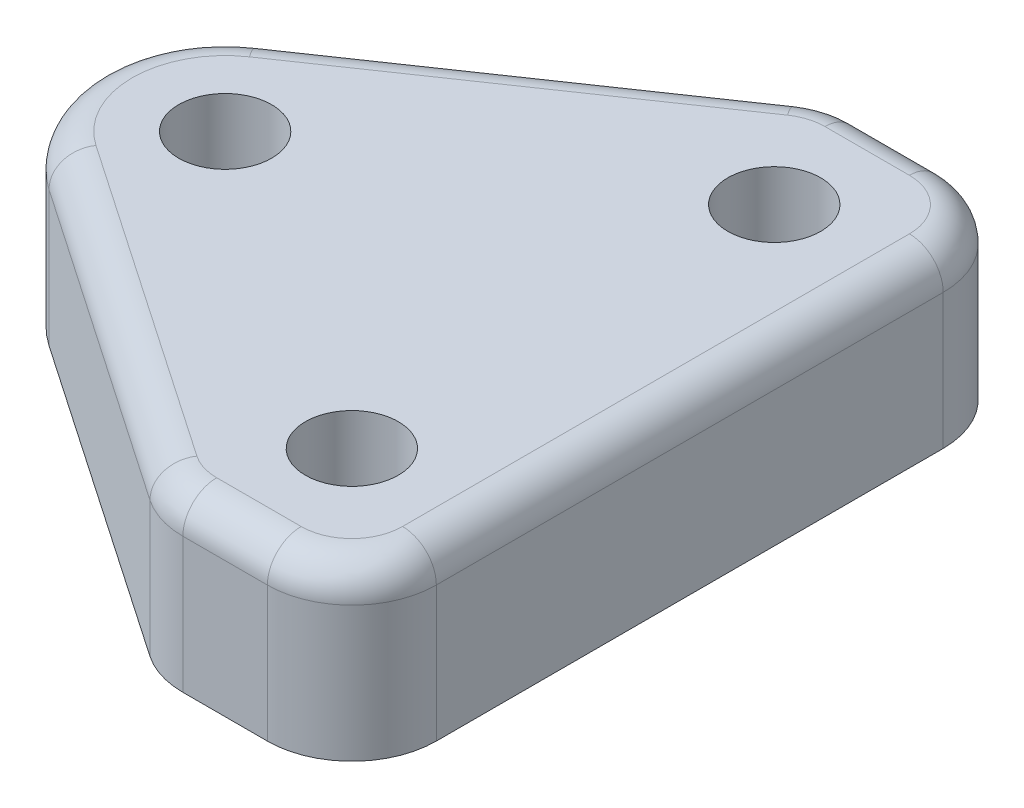
ISO-10303-21;
HEADER;
FILE_DESCRIPTION(('STEP AP214'),'2;1');
FILE_NAME('part.step','',(''),(''),'','','');
FILE_SCHEMA(('AUTOMOTIVE_DESIGN { 1 0 10303 214 1 1 1 1 }'));
ENDSEC;
DATA;
#1=APPLICATION_CONTEXT('core data for automotive mechanical design processes');
#2=APPLICATION_PROTOCOL_DEFINITION('international standard','automotive_design',2000,#1);
#3=PRODUCT_CONTEXT('',#1,'mechanical');
#4=PRODUCT('Part','Part','',(#3));
#5=PRODUCT_RELATED_PRODUCT_CATEGORY('part','',(#4));
#6=PRODUCT_DEFINITION_FORMATION('','',#4);
#7=PRODUCT_DEFINITION_CONTEXT('part definition',#1,'design');
#8=PRODUCT_DEFINITION('design','',#6,#7);
#9=PRODUCT_DEFINITION_SHAPE('','',#8);
#10=(LENGTH_UNIT() NAMED_UNIT(*) SI_UNIT(.MILLI.,.METRE.));
#11=(NAMED_UNIT(*) PLANE_ANGLE_UNIT() SI_UNIT($,.RADIAN.));
#12=(NAMED_UNIT(*) SI_UNIT($,.STERADIAN.) SOLID_ANGLE_UNIT());
#13=UNCERTAINTY_MEASURE_WITH_UNIT(LENGTH_MEASURE(1.E-05),#10,'distance_accuracy_value','');
#14=(GEOMETRIC_REPRESENTATION_CONTEXT(3) GLOBAL_UNCERTAINTY_ASSIGNED_CONTEXT((#13)) GLOBAL_UNIT_ASSIGNED_CONTEXT((#10,
#11,#12)) REPRESENTATION_CONTEXT('',''));
#15=CARTESIAN_POINT('',(0.,0.,0.));
#16=DIRECTION('',(0.,0.,1.));
#17=DIRECTION('',(1.,0.,0.));
#18=AXIS2_PLACEMENT_3D('',#15,#16,#17);
#19=CARTESIAN_POINT('',(0.,10.,0.));
#20=DIRECTION('',(0.,-1.,0.));
#21=DIRECTION('',(0.,0.,-1.));
#22=AXIS2_PLACEMENT_3D('',#19,#20,#21);
#23=CYLINDRICAL_SURFACE('',#22,7.5);
#24=DIRECTION('',(0.,-1.,0.));
#25=VECTOR('',#24,1.);
#26=CARTESIAN_POINT('',(-4.23449191230618,10.,6.19024056435721));
#27=LINE('',#26,#25);
#28=CARTESIAN_POINT('',(-4.23449191230618,8.,6.19024056435721));
#29=VERTEX_POINT('',#28);
#30=CARTESIAN_POINT('',(-4.23449191230618,0.,6.19024056435721));
#31=VERTEX_POINT('',#30);
#32=EDGE_CURVE('E145',#29,#31,#27,.T.);
#33=ORIENTED_EDGE('',*,*,#32,.F.);
#34=CARTESIAN_POINT('',(0.,8.,0.));
#35=DIRECTION('',(0.,1.,0.));
#36=DIRECTION('',(0.,0.,1.));
#37=AXIS2_PLACEMENT_3D('',#34,#35,#36);
#38=CIRCLE('',#37,7.5);
#39=CARTESIAN_POINT('',(-4.23449191230618,8.,-6.19024056435721));
#40=VERTEX_POINT('',#39);
#41=EDGE_CURVE('E11',#29,#40,#38,.F.);
#42=ORIENTED_EDGE('',*,*,#41,.T.);
#43=DIRECTION('',(0.,-1.,0.));
#44=VECTOR('',#43,1.);
#45=CARTESIAN_POINT('',(-4.23449191230618,10.,-6.19024056435721));
#46=LINE('',#45,#44);
#47=CARTESIAN_POINT('',(-4.23449191230618,0.,-6.19024056435721));
#48=VERTEX_POINT('',#47);
#49=EDGE_CURVE('E166',#40,#48,#46,.T.);
#50=ORIENTED_EDGE('',*,*,#49,.T.);
#51=CARTESIAN_POINT('',(0.,0.,0.));
#52=DIRECTION('',(0.,1.,0.));
#53=DIRECTION('',(0.,0.,1.));
#54=AXIS2_PLACEMENT_3D('',#51,#52,#53);
#55=CIRCLE('',#54,7.5);
#56=EDGE_CURVE('E160',#48,#31,#55,.T.);
#57=ORIENTED_EDGE('',*,*,#56,.T.);
#58=EDGE_LOOP('',(#33,#42,#50,#57));
#59=FACE_BOUND('',#58,.T.);
#60=ADVANCED_FACE('F39',(#59),#23,.T.);
#61=CARTESIAN_POINT('',(-4.23449191230618,10.,6.19024056435721));
#62=DIRECTION('',(0.564598921640824,0.,-0.825365408580962));
#63=DIRECTION('',(-0.825365408580962,0.,-0.564598921640824));
#64=AXIS2_PLACEMENT_3D('',#61,#62,#63);
#65=PLANE('',#64);
#66=DIRECTION('',(0.,-1.,0.));
#67=VECTOR('',#66,1.);
#68=CARTESIAN_POINT('',(14.6770053917959,10.,19.1268270429048));
#69=LINE('',#68,#67);
#70=CARTESIAN_POINT('',(14.6770053917959,8.,19.1268270429048));
#71=VERTEX_POINT('',#70);
#72=CARTESIAN_POINT('',(14.6770053917959,0.,19.1268270429048));
#73=VERTEX_POINT('',#72);
#74=EDGE_CURVE('E154',#71,#73,#69,.T.);
#75=ORIENTED_EDGE('',*,*,#74,.F.);
#76=DIRECTION('',(0.825365408580962,0.,0.564598921640824));
#77=VECTOR('',#76,1.);
#78=CARTESIAN_POINT('',(-4.23449191230618,8.,6.19024056435721));
#79=LINE('',#78,#77);
#80=EDGE_CURVE('E48',#71,#29,#79,.F.);
#81=ORIENTED_EDGE('',*,*,#80,.T.);
#82=ORIENTED_EDGE('',*,*,#32,.T.);
#83=DIRECTION('',(0.825365408580962,0.,0.564598921640824));
#84=VECTOR('',#83,1.);
#85=CARTESIAN_POINT('',(-4.23449191230618,0.,6.19024056435721));
#86=LINE('',#85,#84);
#87=EDGE_CURVE('E148',#31,#73,#86,.T.);
#88=ORIENTED_EDGE('',*,*,#87,.T.);
#89=EDGE_LOOP('',(#75,#81,#82,#88));
#90=FACE_BOUND('',#89,.T.);
#91=ADVANCED_FACE('F147',(#90),#65,.F.);
#92=CARTESIAN_POINT('',(17.5,10.,15.));
#93=DIRECTION('',(0.,-1.,0.));
#94=DIRECTION('',(0.,0.,-1.));
#95=AXIS2_PLACEMENT_3D('',#92,#93,#94);
#96=CYLINDRICAL_SURFACE('',#95,5.);
#97=DIRECTION('',(0.,-1.,0.));
#98=VECTOR('',#97,1.);
#99=CARTESIAN_POINT('',(17.5,10.,20.));
#100=LINE('',#99,#98);
#101=CARTESIAN_POINT('',(17.5,8.,20.));
#102=VERTEX_POINT('',#101);
#103=CARTESIAN_POINT('',(17.5,0.,20.));
#104=VERTEX_POINT('',#103);
#105=EDGE_CURVE('E209',#102,#104,#100,.T.);
#106=ORIENTED_EDGE('',*,*,#105,.F.);
#107=CARTESIAN_POINT('',(17.5,8.,15.));
#108=DIRECTION('',(0.,1.,0.));
#109=DIRECTION('',(0.,0.,1.));
#110=AXIS2_PLACEMENT_3D('',#107,#108,#109);
#111=CIRCLE('',#110,5.);
#112=EDGE_CURVE('E63',#102,#71,#111,.F.);
#113=ORIENTED_EDGE('',*,*,#112,.T.);
#114=ORIENTED_EDGE('',*,*,#74,.T.);
#115=CARTESIAN_POINT('',(17.5,0.,15.));
#116=DIRECTION('',(0.,1.,0.));
#117=DIRECTION('',(0.,0.,1.));
#118=AXIS2_PLACEMENT_3D('',#115,#116,#117);
#119=CIRCLE('',#118,5.);
#120=EDGE_CURVE('E163',#73,#104,#119,.T.);
#121=ORIENTED_EDGE('',*,*,#120,.T.);
#122=EDGE_LOOP('',(#106,#113,#114,#121));
#123=FACE_BOUND('',#122,.T.);
#124=ADVANCED_FACE('F323',(#123),#96,.T.);
#125=CARTESIAN_POINT('',(17.5,10.,20.));
#126=DIRECTION('',(0.,0.,-1.));
#127=DIRECTION('',(-1.,0.,0.));
#128=AXIS2_PLACEMENT_3D('',#125,#126,#127);
#129=PLANE('',#128);
#130=DIRECTION('',(0.,-1.,0.));
#131=VECTOR('',#130,1.);
#132=CARTESIAN_POINT('',(22.5,10.,20.));
#133=LINE('',#132,#131);
#134=CARTESIAN_POINT('',(22.5,8.,20.));
#135=VERTEX_POINT('',#134);
#136=CARTESIAN_POINT('',(22.5,0.,20.));
#137=VERTEX_POINT('',#136);
#138=EDGE_CURVE('E207',#135,#137,#133,.T.);
#139=ORIENTED_EDGE('',*,*,#138,.F.);
#140=DIRECTION('',(1.,0.,0.));
#141=VECTOR('',#140,1.);
#142=CARTESIAN_POINT('',(17.5,8.,20.));
#143=LINE('',#142,#141);
#144=EDGE_CURVE('E245',#135,#102,#143,.F.);
#145=ORIENTED_EDGE('',*,*,#144,.T.);
#146=ORIENTED_EDGE('',*,*,#105,.T.);
#147=DIRECTION('',(1.,0.,0.));
#148=VECTOR('',#147,1.);
#149=CARTESIAN_POINT('',(17.5,0.,20.));
#150=LINE('',#149,#148);
#151=EDGE_CURVE('E176',#104,#137,#150,.T.);
#152=ORIENTED_EDGE('',*,*,#151,.T.);
#153=EDGE_LOOP('',(#139,#145,#146,#152));
#154=FACE_BOUND('',#153,.T.);
#155=ADVANCED_FACE('F373',(#154),#129,.F.);
#156=CARTESIAN_POINT('',(22.5,10.,15.));
#157=DIRECTION('',(0.,-1.,0.));
#158=DIRECTION('',(0.,0.,-1.));
#159=AXIS2_PLACEMENT_3D('',#156,#157,#158);
#160=CYLINDRICAL_SURFACE('',#159,5.);
#161=DIRECTION('',(0.,-1.,0.));
#162=VECTOR('',#161,1.);
#163=CARTESIAN_POINT('',(27.5,10.,15.));
#164=LINE('',#163,#162);
#165=CARTESIAN_POINT('',(27.5,8.,15.));
#166=VERTEX_POINT('',#165);
#167=CARTESIAN_POINT('',(27.5,0.,15.));
#168=VERTEX_POINT('',#167);
#169=EDGE_CURVE('E205',#166,#168,#164,.T.);
#170=ORIENTED_EDGE('',*,*,#169,.F.);
#171=CARTESIAN_POINT('',(22.5,8.,15.));
#172=DIRECTION('',(0.,1.,0.));
#173=DIRECTION('',(0.,0.,1.));
#174=AXIS2_PLACEMENT_3D('',#171,#172,#173);
#175=CIRCLE('',#174,5.);
#176=EDGE_CURVE('E243',#166,#135,#175,.F.);
#177=ORIENTED_EDGE('',*,*,#176,.T.);
#178=ORIENTED_EDGE('',*,*,#138,.T.);
#179=CARTESIAN_POINT('',(22.5,0.,15.));
#180=DIRECTION('',(0.,1.,0.));
#181=DIRECTION('',(0.,0.,1.));
#182=AXIS2_PLACEMENT_3D('',#179,#180,#181);
#183=CIRCLE('',#182,5.);
#184=EDGE_CURVE('E179',#137,#168,#183,.T.);
#185=ORIENTED_EDGE('',*,*,#184,.T.);
#186=EDGE_LOOP('',(#170,#177,#178,#185));
#187=FACE_BOUND('',#186,.T.);
#188=ADVANCED_FACE('F379',(#187),#160,.T.);
#189=CARTESIAN_POINT('',(27.5,10.,15.));
#190=DIRECTION('',(-1.,0.,0.));
#191=DIRECTION('',(0.,0.,1.));
#192=AXIS2_PLACEMENT_3D('',#189,#190,#191);
#193=PLANE('',#192);
#194=DIRECTION('',(0.,-1.,0.));
#195=VECTOR('',#194,1.);
#196=CARTESIAN_POINT('',(27.5,10.,-15.));
#197=LINE('',#196,#195);
#198=CARTESIAN_POINT('',(27.5,8.,-15.));
#199=VERTEX_POINT('',#198);
#200=CARTESIAN_POINT('',(27.5,0.,-15.));
#201=VERTEX_POINT('',#200);
#202=EDGE_CURVE('E203',#199,#201,#197,.T.);
#203=ORIENTED_EDGE('',*,*,#202,.F.);
#204=DIRECTION('',(0.,0.,-1.));
#205=VECTOR('',#204,1.);
#206=CARTESIAN_POINT('',(27.5,8.,15.));
#207=LINE('',#206,#205);
#208=EDGE_CURVE('E241',#199,#166,#207,.F.);
#209=ORIENTED_EDGE('',*,*,#208,.T.);
#210=ORIENTED_EDGE('',*,*,#169,.T.);
#211=DIRECTION('',(0.,0.,-1.));
#212=VECTOR('',#211,1.);
#213=CARTESIAN_POINT('',(27.5,0.,15.));
#214=LINE('',#213,#212);
#215=EDGE_CURVE('E182',#168,#201,#214,.T.);
#216=ORIENTED_EDGE('',*,*,#215,.T.);
#217=EDGE_LOOP('',(#203,#209,#210,#216));
#218=FACE_BOUND('',#217,.T.);
#219=ADVANCED_FACE('F382',(#218),#193,.F.);
#220=CARTESIAN_POINT('',(22.5,10.,-15.));
#221=DIRECTION('',(0.,-1.,0.));
#222=DIRECTION('',(0.,0.,-1.));
#223=AXIS2_PLACEMENT_3D('',#220,#221,#222);
#224=CYLINDRICAL_SURFACE('',#223,5.);
#225=DIRECTION('',(0.,-1.,0.));
#226=VECTOR('',#225,1.);
#227=CARTESIAN_POINT('',(22.5,10.,-20.));
#228=LINE('',#227,#226);
#229=CARTESIAN_POINT('',(22.5,8.,-20.));
#230=VERTEX_POINT('',#229);
#231=CARTESIAN_POINT('',(22.5,0.,-20.));
#232=VERTEX_POINT('',#231);
#233=EDGE_CURVE('E201',#230,#232,#228,.T.);
#234=ORIENTED_EDGE('',*,*,#233,.F.);
#235=CARTESIAN_POINT('',(22.5,8.,-15.));
#236=DIRECTION('',(0.,1.,0.));
#237=DIRECTION('',(0.,0.,1.));
#238=AXIS2_PLACEMENT_3D('',#235,#236,#237);
#239=CIRCLE('',#238,5.);
#240=EDGE_CURVE('E239',#230,#199,#239,.F.);
#241=ORIENTED_EDGE('',*,*,#240,.T.);
#242=ORIENTED_EDGE('',*,*,#202,.T.);
#243=CARTESIAN_POINT('',(22.5,0.,-15.));
#244=DIRECTION('',(0.,1.,0.));
#245=DIRECTION('',(0.,0.,1.));
#246=AXIS2_PLACEMENT_3D('',#243,#244,#245);
#247=CIRCLE('',#246,5.);
#248=EDGE_CURVE('E185',#201,#232,#247,.T.);
#249=ORIENTED_EDGE('',*,*,#248,.T.);
#250=EDGE_LOOP('',(#234,#241,#242,#249));
#251=FACE_BOUND('',#250,.T.);
#252=ADVANCED_FACE('F410',(#251),#224,.T.);
#253=CARTESIAN_POINT('',(22.5,10.,-20.));
#254=DIRECTION('',(0.,0.,1.));
#255=DIRECTION('',(1.,0.,0.));
#256=AXIS2_PLACEMENT_3D('',#253,#254,#255);
#257=PLANE('',#256);
#258=DIRECTION('',(0.,-1.,0.));
#259=VECTOR('',#258,1.);
#260=CARTESIAN_POINT('',(17.5,10.,-20.));
#261=LINE('',#260,#259);
#262=CARTESIAN_POINT('',(17.5,8.,-20.));
#263=VERTEX_POINT('',#262);
#264=CARTESIAN_POINT('',(17.5,0.,-20.));
#265=VERTEX_POINT('',#264);
#266=EDGE_CURVE('E199',#263,#265,#261,.T.);
#267=ORIENTED_EDGE('',*,*,#266,.F.);
#268=DIRECTION('',(-1.,0.,0.));
#269=VECTOR('',#268,1.);
#270=CARTESIAN_POINT('',(22.5,8.,-20.));
#271=LINE('',#270,#269);
#272=EDGE_CURVE('E237',#263,#230,#271,.F.);
#273=ORIENTED_EDGE('',*,*,#272,.T.);
#274=ORIENTED_EDGE('',*,*,#233,.T.);
#275=DIRECTION('',(-1.,0.,0.));
#276=VECTOR('',#275,1.);
#277=CARTESIAN_POINT('',(22.5,0.,-20.));
#278=LINE('',#277,#276);
#279=EDGE_CURVE('E188',#232,#265,#278,.T.);
#280=ORIENTED_EDGE('',*,*,#279,.T.);
#281=EDGE_LOOP('',(#267,#273,#274,#280));
#282=FACE_BOUND('',#281,.T.);
#283=ADVANCED_FACE('F405',(#282),#257,.F.);
#284=CARTESIAN_POINT('',(17.5,10.,-15.));
#285=DIRECTION('',(0.,-1.,0.));
#286=DIRECTION('',(0.,0.,-1.));
#287=AXIS2_PLACEMENT_3D('',#284,#285,#286);
#288=CYLINDRICAL_SURFACE('',#287,5.);
#289=DIRECTION('',(0.,-1.,0.));
#290=VECTOR('',#289,1.);
#291=CARTESIAN_POINT('',(14.6770053917959,10.,-19.1268270429048));
#292=LINE('',#291,#290);
#293=CARTESIAN_POINT('',(14.6770053917959,8.,-19.1268270429048));
#294=VERTEX_POINT('',#293);
#295=CARTESIAN_POINT('',(14.6770053917959,0.,-19.1268270429048));
#296=VERTEX_POINT('',#295);
#297=EDGE_CURVE('E197',#294,#296,#292,.T.);
#298=ORIENTED_EDGE('',*,*,#297,.F.);
#299=CARTESIAN_POINT('',(17.5,8.,-15.));
#300=DIRECTION('',(0.,1.,0.));
#301=DIRECTION('',(0.,0.,1.));
#302=AXIS2_PLACEMENT_3D('',#299,#300,#301);
#303=CIRCLE('',#302,5.);
#304=EDGE_CURVE('E235',#294,#263,#303,.F.);
#305=ORIENTED_EDGE('',*,*,#304,.T.);
#306=ORIENTED_EDGE('',*,*,#266,.T.);
#307=CARTESIAN_POINT('',(17.5,0.,-15.));
#308=DIRECTION('',(0.,1.,0.));
#309=DIRECTION('',(0.,0.,1.));
#310=AXIS2_PLACEMENT_3D('',#307,#308,#309);
#311=CIRCLE('',#310,5.);
#312=EDGE_CURVE('E191',#265,#296,#311,.T.);
#313=ORIENTED_EDGE('',*,*,#312,.T.);
#314=EDGE_LOOP('',(#298,#305,#306,#313));
#315=FACE_BOUND('',#314,.T.);
#316=ADVANCED_FACE('F312',(#315),#288,.T.);
#317=CARTESIAN_POINT('',(14.6770053917959,10.,-19.1268270429048));
#318=DIRECTION('',(0.564598921640824,0.,0.825365408580962));
#319=DIRECTION('',(0.825365408580962,0.,-0.564598921640824));
#320=AXIS2_PLACEMENT_3D('',#317,#318,#319);
#321=PLANE('',#320);
#322=ORIENTED_EDGE('',*,*,#49,.F.);
#323=DIRECTION('',(-0.825365408580962,0.,0.564598921640824));
#324=VECTOR('',#323,1.);
#325=CARTESIAN_POINT('',(14.6770053917959,8.,-19.1268270429048));
#326=LINE('',#325,#324);
#327=EDGE_CURVE('E232',#40,#294,#326,.F.);
#328=ORIENTED_EDGE('',*,*,#327,.T.);
#329=ORIENTED_EDGE('',*,*,#297,.T.);
#330=DIRECTION('',(-0.825365408580962,0.,0.564598921640824));
#331=VECTOR('',#330,1.);
#332=CARTESIAN_POINT('',(14.6770053917959,0.,-19.1268270429048));
#333=LINE('',#332,#331);
#334=EDGE_CURVE('E194',#296,#48,#333,.T.);
#335=ORIENTED_EDGE('',*,*,#334,.T.);
#336=EDGE_LOOP('',(#322,#328,#329,#335));
#337=FACE_BOUND('',#336,.T.);
#338=ADVANCED_FACE('F302',(#337),#321,.F.);
#339=CARTESIAN_POINT('',(0.,10.,0.));
#340=DIRECTION('',(0.,1.,0.));
#341=DIRECTION('',(0.,0.,1.));
#342=AXIS2_PLACEMENT_3D('',#339,#340,#341);
#343=PLANE('',#342);
#344=CARTESIAN_POINT('',(17.5,10.,-15.));
#345=DIRECTION('',(0.,1.,0.));
#346=DIRECTION('',(0.,0.,1.));
#347=AXIS2_PLACEMENT_3D('',#344,#345,#346);
#348=CIRCLE('',#347,3.);
#349=CARTESIAN_POINT('',(17.5,10.,-18.));
#350=VERTEX_POINT('',#349);
#351=CARTESIAN_POINT('',(15.8062032350775,10.,-17.4760962257429));
#352=VERTEX_POINT('',#351);
#353=EDGE_CURVE('E227',#350,#352,#348,.T.);
#354=ORIENTED_EDGE('',*,*,#353,.T.);
#355=DIRECTION('',(-0.825365408580962,0.,0.564598921640824));
#356=VECTOR('',#355,1.);
#357=CARTESIAN_POINT('',(-3.10529406902453,10.,-4.53950974719528));
#358=LINE('',#357,#356);
#359=CARTESIAN_POINT('',(-3.10529406902453,10.,-4.53950974719529));
#360=VERTEX_POINT('',#359);
#361=EDGE_CURVE('E229',#352,#360,#358,.T.);
#362=ORIENTED_EDGE('',*,*,#361,.T.);
#363=CARTESIAN_POINT('',(0.,10.,0.));
#364=DIRECTION('',(0.,1.,0.));
#365=DIRECTION('',(0.,0.,1.));
#366=AXIS2_PLACEMENT_3D('',#363,#364,#365);
#367=CIRCLE('',#366,5.5);
#368=CARTESIAN_POINT('',(-3.10529406902453,10.,4.53950974719529));
#369=VERTEX_POINT('',#368);
#370=EDGE_CURVE('E153',#360,#369,#367,.T.);
#371=ORIENTED_EDGE('',*,*,#370,.T.);
#372=DIRECTION('',(0.825365408580962,0.,0.564598921640824));
#373=VECTOR('',#372,1.);
#374=CARTESIAN_POINT('',(15.8062032350775,10.,17.4760962257429));
#375=LINE('',#374,#373);
#376=CARTESIAN_POINT('',(15.8062032350775,10.,17.4760962257429));
#377=VERTEX_POINT('',#376);
#378=EDGE_CURVE('E213',#369,#377,#375,.T.);
#379=ORIENTED_EDGE('',*,*,#378,.T.);
#380=CARTESIAN_POINT('',(17.5,10.,15.));
#381=DIRECTION('',(0.,1.,0.));
#382=DIRECTION('',(0.,0.,1.));
#383=AXIS2_PLACEMENT_3D('',#380,#381,#382);
#384=CIRCLE('',#383,3.);
#385=CARTESIAN_POINT('',(17.5,10.,18.));
#386=VERTEX_POINT('',#385);
#387=EDGE_CURVE('E215',#377,#386,#384,.T.);
#388=ORIENTED_EDGE('',*,*,#387,.T.);
#389=DIRECTION('',(1.,0.,0.));
#390=VECTOR('',#389,1.);
#391=CARTESIAN_POINT('',(22.5,10.,18.));
#392=LINE('',#391,#390);
#393=CARTESIAN_POINT('',(22.5,10.,18.));
#394=VERTEX_POINT('',#393);
#395=EDGE_CURVE('E217',#386,#394,#392,.T.);
#396=ORIENTED_EDGE('',*,*,#395,.T.);
#397=CARTESIAN_POINT('',(22.5,10.,15.));
#398=DIRECTION('',(0.,1.,0.));
#399=DIRECTION('',(0.,0.,1.));
#400=AXIS2_PLACEMENT_3D('',#397,#398,#399);
#401=CIRCLE('',#400,3.);
#402=CARTESIAN_POINT('',(25.5,10.,15.));
#403=VERTEX_POINT('',#402);
#404=EDGE_CURVE('E219',#394,#403,#401,.T.);
#405=ORIENTED_EDGE('',*,*,#404,.T.);
#406=DIRECTION('',(0.,0.,-1.));
#407=VECTOR('',#406,1.);
#408=CARTESIAN_POINT('',(25.5,10.,-15.));
#409=LINE('',#408,#407);
#410=CARTESIAN_POINT('',(25.5,10.,-15.));
#411=VERTEX_POINT('',#410);
#412=EDGE_CURVE('E221',#403,#411,#409,.T.);
#413=ORIENTED_EDGE('',*,*,#412,.T.);
#414=CARTESIAN_POINT('',(22.5,10.,-15.));
#415=DIRECTION('',(0.,1.,0.));
#416=DIRECTION('',(0.,0.,1.));
#417=AXIS2_PLACEMENT_3D('',#414,#415,#416);
#418=CIRCLE('',#417,3.);
#419=CARTESIAN_POINT('',(22.5,10.,-18.));
#420=VERTEX_POINT('',#419);
#421=EDGE_CURVE('E223',#411,#420,#418,.T.);
#422=ORIENTED_EDGE('',*,*,#421,.T.);
#423=DIRECTION('',(-1.,0.,0.));
#424=VECTOR('',#423,1.);
#425=CARTESIAN_POINT('',(17.5,10.,-18.));
#426=LINE('',#425,#424);
#427=EDGE_CURVE('E225',#420,#350,#426,.T.);
#428=ORIENTED_EDGE('',*,*,#427,.T.);
#429=EDGE_LOOP('',(#354,#362,#371,#379,#388,#396,#405,#413,#422,#428));
#430=FACE_BOUND('',#429,.T.);
#431=CARTESIAN_POINT('',(0.,10.,0.));
#432=DIRECTION('',(0.,1.,0.));
#433=DIRECTION('',(0.,0.,1.));
#434=AXIS2_PLACEMENT_3D('',#431,#432,#433);
#435=CIRCLE('',#434,2.74999999999999);
#436=CARTESIAN_POINT('',(0.,10.,2.74999999999999));
#437=VERTEX_POINT('',#436);
#438=EDGE_CURVE('E277',#437,#437,#435,.T.);
#439=ORIENTED_EDGE('',*,*,#438,.F.);
#440=EDGE_LOOP('',(#439));
#441=FACE_BOUND('',#440,.T.);
#442=CARTESIAN_POINT('',(20.,10.,-12.5));
#443=DIRECTION('',(0.,1.,0.));
#444=DIRECTION('',(0.,0.,1.));
#445=AXIS2_PLACEMENT_3D('',#442,#443,#444);
#446=CIRCLE('',#445,2.74999999999999);
#447=CARTESIAN_POINT('',(20.,10.,-9.75000000000001));
#448=VERTEX_POINT('',#447);
#449=EDGE_CURVE('E288',#448,#448,#446,.T.);
#450=ORIENTED_EDGE('',*,*,#449,.F.);
#451=EDGE_LOOP('',(#450));
#452=FACE_BOUND('',#451,.T.);
#453=CARTESIAN_POINT('',(20.,10.,12.5));
#454=DIRECTION('',(0.,1.,0.));
#455=DIRECTION('',(0.,0.,1.));
#456=AXIS2_PLACEMENT_3D('',#453,#454,#455);
#457=CIRCLE('',#456,2.74999999999999);
#458=CARTESIAN_POINT('',(20.,10.,15.25));
#459=VERTEX_POINT('',#458);
#460=EDGE_CURVE('E171',#459,#459,#457,.T.);
#461=ORIENTED_EDGE('',*,*,#460,.F.);
#462=EDGE_LOOP('',(#461));
#463=FACE_BOUND('',#462,.T.);
#464=ADVANCED_FACE('F300',(#430,#441,#452,#463),#343,.T.);
#465=CARTESIAN_POINT('',(0.,0.,0.));
#466=DIRECTION('',(0.,1.,0.));
#467=DIRECTION('',(0.,0.,1.));
#468=AXIS2_PLACEMENT_3D('',#465,#466,#467);
#469=PLANE('',#468);
#470=CARTESIAN_POINT('',(0.,0.,0.));
#471=DIRECTION('',(0.,1.,0.));
#472=DIRECTION('',(0.,0.,1.));
#473=AXIS2_PLACEMENT_3D('',#470,#471,#472);
#474=CIRCLE('',#473,2.75);
#475=CARTESIAN_POINT('',(0.,0.,2.75));
#476=VERTEX_POINT('',#475);
#477=EDGE_CURVE('E283',#476,#476,#474,.T.);
#478=ORIENTED_EDGE('',*,*,#477,.T.);
#479=EDGE_LOOP('',(#478));
#480=FACE_BOUND('',#479,.T.);
#481=CARTESIAN_POINT('',(20.,0.,-12.5));
#482=DIRECTION('',(0.,1.,0.));
#483=DIRECTION('',(0.,0.,1.));
#484=AXIS2_PLACEMENT_3D('',#481,#482,#483);
#485=CIRCLE('',#484,2.75);
#486=CARTESIAN_POINT('',(20.,0.,-9.75));
#487=VERTEX_POINT('',#486);
#488=EDGE_CURVE('E293',#487,#487,#485,.T.);
#489=ORIENTED_EDGE('',*,*,#488,.T.);
#490=EDGE_LOOP('',(#489));
#491=FACE_BOUND('',#490,.T.);
#492=CARTESIAN_POINT('',(20.,0.,12.5));
#493=DIRECTION('',(0.,1.,0.));
#494=DIRECTION('',(0.,0.,1.));
#495=AXIS2_PLACEMENT_3D('',#492,#493,#494);
#496=CIRCLE('',#495,2.75);
#497=CARTESIAN_POINT('',(20.,0.,15.25));
#498=VERTEX_POINT('',#497);
#499=EDGE_CURVE('E168',#498,#498,#496,.T.);
#500=ORIENTED_EDGE('',*,*,#499,.T.);
#501=EDGE_LOOP('',(#500));
#502=FACE_BOUND('',#501,.T.);
#503=ORIENTED_EDGE('',*,*,#56,.F.);
#504=ORIENTED_EDGE('',*,*,#334,.F.);
#505=ORIENTED_EDGE('',*,*,#312,.F.);
#506=ORIENTED_EDGE('',*,*,#279,.F.);
#507=ORIENTED_EDGE('',*,*,#248,.F.);
#508=ORIENTED_EDGE('',*,*,#215,.F.);
#509=ORIENTED_EDGE('',*,*,#184,.F.);
#510=ORIENTED_EDGE('',*,*,#151,.F.);
#511=ORIENTED_EDGE('',*,*,#120,.F.);
#512=ORIENTED_EDGE('',*,*,#87,.F.);
#513=EDGE_LOOP('',(#503,#504,#505,#506,#507,#508,#509,#510,#511,#512));
#514=FACE_BOUND('',#513,.T.);
#515=ADVANCED_FACE('F158',(#480,#491,#502,#514),#469,.F.);
#516=CARTESIAN_POINT('',(20.,10.,12.5));
#517=DIRECTION('',(0.,1.,0.));
#518=DIRECTION('',(0.,0.,1.));
#519=AXIS2_PLACEMENT_3D('',#516,#517,#518);
#520=CYLINDRICAL_SURFACE('',#519,2.74999999999999);
#521=ORIENTED_EDGE('',*,*,#499,.F.);
#522=EDGE_LOOP('',(#521));
#523=FACE_BOUND('',#522,.T.);
#524=ORIENTED_EDGE('',*,*,#460,.T.);
#525=EDGE_LOOP('',(#524));
#526=FACE_BOUND('',#525,.T.);
#527=ADVANCED_FACE('F298',(#523,#526),#520,.F.);
#528=CARTESIAN_POINT('',(20.,10.,-12.5));
#529=DIRECTION('',(0.,1.,0.));
#530=DIRECTION('',(0.,0.,1.));
#531=AXIS2_PLACEMENT_3D('',#528,#529,#530);
#532=CYLINDRICAL_SURFACE('',#531,2.74999999999999);
#533=ORIENTED_EDGE('',*,*,#488,.F.);
#534=EDGE_LOOP('',(#533));
#535=FACE_BOUND('',#534,.T.);
#536=ORIENTED_EDGE('',*,*,#449,.T.);
#537=EDGE_LOOP('',(#536));
#538=FACE_BOUND('',#537,.T.);
#539=ADVANCED_FACE('F365',(#535,#538),#532,.F.);
#540=CARTESIAN_POINT('',(0.,10.,0.));
#541=DIRECTION('',(0.,1.,0.));
#542=DIRECTION('',(0.,0.,1.));
#543=AXIS2_PLACEMENT_3D('',#540,#541,#542);
#544=CYLINDRICAL_SURFACE('',#543,2.74999999999999);
#545=ORIENTED_EDGE('',*,*,#477,.F.);
#546=EDGE_LOOP('',(#545));
#547=FACE_BOUND('',#546,.T.);
#548=ORIENTED_EDGE('',*,*,#438,.T.);
#549=EDGE_LOOP('',(#548));
#550=FACE_BOUND('',#549,.T.);
#551=ADVANCED_FACE('F361',(#547,#550),#544,.F.);
#552=CARTESIAN_POINT('',(22.5,8.,15.));
#553=DIRECTION('',(0.,1.,0.));
#554=DIRECTION('',(0.,0.,1.));
#555=AXIS2_PLACEMENT_3D('',#552,#553,#554);
#556=TOROIDAL_SURFACE('',#555,3.,2.);
#557=CARTESIAN_POINT('',(22.5,8.,18.));
#558=DIRECTION('',(-1.,0.,0.));
#559=DIRECTION('',(0.,0.,1.));
#560=AXIS2_PLACEMENT_3D('',#557,#558,#559);
#561=CIRCLE('',#560,2.);
#562=EDGE_CURVE('E270',#135,#394,#561,.T.);
#563=ORIENTED_EDGE('',*,*,#562,.F.);
#564=ORIENTED_EDGE('',*,*,#176,.F.);
#565=CARTESIAN_POINT('',(25.5,8.,15.));
#566=DIRECTION('',(0.,0.,-1.));
#567=DIRECTION('',(-1.,0.,0.));
#568=AXIS2_PLACEMENT_3D('',#565,#566,#567);
#569=CIRCLE('',#568,2.);
#570=EDGE_CURVE('E43',#403,#166,#569,.T.);
#571=ORIENTED_EDGE('',*,*,#570,.F.);
#572=ORIENTED_EDGE('',*,*,#404,.F.);
#573=EDGE_LOOP('',(#563,#564,#571,#572));
#574=FACE_BOUND('',#573,.T.);
#575=ADVANCED_FACE('F41',(#574),#556,.T.);
#576=CARTESIAN_POINT('',(25.5,8.,0.));
#577=DIRECTION('',(0.,0.,1.));
#578=DIRECTION('',(1.,0.,0.));
#579=AXIS2_PLACEMENT_3D('',#576,#577,#578);
#580=CYLINDRICAL_SURFACE('',#579,2.);
#581=ORIENTED_EDGE('',*,*,#570,.T.);
#582=ORIENTED_EDGE('',*,*,#208,.F.);
#583=CARTESIAN_POINT('',(25.5,8.,-15.));
#584=DIRECTION('',(0.,0.,-1.));
#585=DIRECTION('',(-1.,0.,0.));
#586=AXIS2_PLACEMENT_3D('',#583,#584,#585);
#587=CIRCLE('',#586,2.);
#588=EDGE_CURVE('E268',#411,#199,#587,.T.);
#589=ORIENTED_EDGE('',*,*,#588,.F.);
#590=ORIENTED_EDGE('',*,*,#412,.F.);
#591=EDGE_LOOP('',(#581,#582,#589,#590));
#592=FACE_BOUND('',#591,.T.);
#593=ADVANCED_FACE('F357',(#592),#580,.T.);
#594=CARTESIAN_POINT('',(0.,8.,18.));
#595=DIRECTION('',(-1.,0.,0.));
#596=DIRECTION('',(0.,0.,1.));
#597=AXIS2_PLACEMENT_3D('',#594,#595,#596);
#598=CYLINDRICAL_SURFACE('',#597,2.);
#599=ORIENTED_EDGE('',*,*,#562,.T.);
#600=ORIENTED_EDGE('',*,*,#395,.F.);
#601=CARTESIAN_POINT('',(17.5,8.,18.));
#602=DIRECTION('',(-1.,0.,0.));
#603=DIRECTION('',(0.,0.,1.));
#604=AXIS2_PLACEMENT_3D('',#601,#602,#603);
#605=CIRCLE('',#604,2.);
#606=EDGE_CURVE('E265',#102,#386,#605,.T.);
#607=ORIENTED_EDGE('',*,*,#606,.F.);
#608=ORIENTED_EDGE('',*,*,#144,.F.);
#609=EDGE_LOOP('',(#599,#600,#607,#608));
#610=FACE_BOUND('',#609,.T.);
#611=ADVANCED_FACE('F354',(#610),#598,.T.);
#612=CARTESIAN_POINT('',(22.5,8.,-15.));
#613=DIRECTION('',(0.,1.,0.));
#614=DIRECTION('',(0.,0.,1.));
#615=AXIS2_PLACEMENT_3D('',#612,#613,#614);
#616=TOROIDAL_SURFACE('',#615,3.,2.);
#617=ORIENTED_EDGE('',*,*,#588,.T.);
#618=ORIENTED_EDGE('',*,*,#240,.F.);
#619=CARTESIAN_POINT('',(22.5,8.,-18.));
#620=DIRECTION('',(-1.,0.,0.));
#621=DIRECTION('',(0.,0.,1.));
#622=AXIS2_PLACEMENT_3D('',#619,#620,#621);
#623=CIRCLE('',#622,2.);
#624=EDGE_CURVE('E262',#420,#230,#623,.T.);
#625=ORIENTED_EDGE('',*,*,#624,.F.);
#626=ORIENTED_EDGE('',*,*,#421,.F.);
#627=EDGE_LOOP('',(#617,#618,#625,#626));
#628=FACE_BOUND('',#627,.T.);
#629=ADVANCED_FACE('F350',(#628),#616,.T.);
#630=CARTESIAN_POINT('',(17.5,8.,15.));
#631=DIRECTION('',(0.,1.,0.));
#632=DIRECTION('',(0.,0.,1.));
#633=AXIS2_PLACEMENT_3D('',#630,#631,#632);
#634=TOROIDAL_SURFACE('',#633,3.,2.);
#635=ORIENTED_EDGE('',*,*,#606,.T.);
#636=ORIENTED_EDGE('',*,*,#387,.F.);
#637=CARTESIAN_POINT('',(15.8062032350775,8.,17.4760962257429));
#638=DIRECTION('',(-0.825365408580962,0.,-0.564598921640824));
#639=DIRECTION('',(-0.564598921640824,0.,0.825365408580962));
#640=AXIS2_PLACEMENT_3D('',#637,#638,#639);
#641=CIRCLE('',#640,2.);
#642=EDGE_CURVE('E259',#71,#377,#641,.T.);
#643=ORIENTED_EDGE('',*,*,#642,.F.);
#644=ORIENTED_EDGE('',*,*,#112,.F.);
#645=EDGE_LOOP('',(#635,#636,#643,#644));
#646=FACE_BOUND('',#645,.T.);
#647=ADVANCED_FACE('F346',(#646),#634,.T.);
#648=CARTESIAN_POINT('',(0.,8.,-18.));
#649=DIRECTION('',(1.,0.,0.));
#650=DIRECTION('',(0.,0.,-1.));
#651=AXIS2_PLACEMENT_3D('',#648,#649,#650);
#652=CYLINDRICAL_SURFACE('',#651,2.);
#653=ORIENTED_EDGE('',*,*,#624,.T.);
#654=ORIENTED_EDGE('',*,*,#272,.F.);
#655=CARTESIAN_POINT('',(17.5,8.,-18.));
#656=DIRECTION('',(-1.,0.,0.));
#657=DIRECTION('',(0.,0.,1.));
#658=AXIS2_PLACEMENT_3D('',#655,#656,#657);
#659=CIRCLE('',#658,2.);
#660=EDGE_CURVE('E256',#350,#263,#659,.T.);
#661=ORIENTED_EDGE('',*,*,#660,.F.);
#662=ORIENTED_EDGE('',*,*,#427,.F.);
#663=EDGE_LOOP('',(#653,#654,#661,#662));
#664=FACE_BOUND('',#663,.T.);
#665=ADVANCED_FACE('F342',(#664),#652,.T.);
#666=CARTESIAN_POINT('',(-3.10529406902453,8.,4.53950974719529));
#667=DIRECTION('',(-0.825365408580962,0.,-0.564598921640824));
#668=DIRECTION('',(-0.564598921640824,0.,0.825365408580962));
#669=AXIS2_PLACEMENT_3D('',#666,#667,#668);
#670=CYLINDRICAL_SURFACE('',#669,2.);
#671=ORIENTED_EDGE('',*,*,#642,.T.);
#672=ORIENTED_EDGE('',*,*,#378,.F.);
#673=CARTESIAN_POINT('',(-3.10529406902453,8.,4.53950974719529));
#674=DIRECTION('',(-0.825365408580962,0.,-0.564598921640824));
#675=DIRECTION('',(-0.564598921640824,0.,0.825365408580962));
#676=AXIS2_PLACEMENT_3D('',#673,#674,#675);
#677=CIRCLE('',#676,2.);
#678=EDGE_CURVE('E253',#29,#369,#677,.T.);
#679=ORIENTED_EDGE('',*,*,#678,.F.);
#680=ORIENTED_EDGE('',*,*,#80,.F.);
#681=EDGE_LOOP('',(#671,#672,#679,#680));
#682=FACE_BOUND('',#681,.T.);
#683=ADVANCED_FACE('F338',(#682),#670,.T.);
#684=CARTESIAN_POINT('',(17.5,8.,-15.));
#685=DIRECTION('',(0.,1.,0.));
#686=DIRECTION('',(0.,0.,1.));
#687=AXIS2_PLACEMENT_3D('',#684,#685,#686);
#688=TOROIDAL_SURFACE('',#687,3.,2.);
#689=ORIENTED_EDGE('',*,*,#660,.T.);
#690=ORIENTED_EDGE('',*,*,#304,.F.);
#691=CARTESIAN_POINT('',(15.8062032350775,8.,-17.4760962257429));
#692=DIRECTION('',(-0.825365408580962,0.,0.564598921640824));
#693=DIRECTION('',(0.564598921640824,0.,0.825365408580962));
#694=AXIS2_PLACEMENT_3D('',#691,#692,#693);
#695=CIRCLE('',#694,2.);
#696=EDGE_CURVE('E251',#352,#294,#695,.T.);
#697=ORIENTED_EDGE('',*,*,#696,.F.);
#698=ORIENTED_EDGE('',*,*,#353,.F.);
#699=EDGE_LOOP('',(#689,#690,#697,#698));
#700=FACE_BOUND('',#699,.T.);
#701=ADVANCED_FACE('F334',(#700),#688,.T.);
#702=CARTESIAN_POINT('',(0.,8.,0.));
#703=DIRECTION('',(0.,1.,0.));
#704=DIRECTION('',(0.,0.,1.));
#705=AXIS2_PLACEMENT_3D('',#702,#703,#704);
#706=TOROIDAL_SURFACE('',#705,5.5,2.);
#707=ORIENTED_EDGE('',*,*,#678,.T.);
#708=ORIENTED_EDGE('',*,*,#370,.F.);
#709=CARTESIAN_POINT('',(-3.10529406902453,8.,-4.53950974719529));
#710=DIRECTION('',(0.825365408580962,0.,-0.564598921640824));
#711=DIRECTION('',(-0.564598921640824,0.,-0.825365408580962));
#712=AXIS2_PLACEMENT_3D('',#709,#710,#711);
#713=CIRCLE('',#712,2.);
#714=EDGE_CURVE('E249',#40,#360,#713,.T.);
#715=ORIENTED_EDGE('',*,*,#714,.F.);
#716=ORIENTED_EDGE('',*,*,#41,.F.);
#717=EDGE_LOOP('',(#707,#708,#715,#716));
#718=FACE_BOUND('',#717,.T.);
#719=ADVANCED_FACE('F330',(#718),#706,.T.);
#720=CARTESIAN_POINT('',(-3.10529406902453,8.,-4.53950974719528));
#721=DIRECTION('',(0.825365408580962,0.,-0.564598921640824));
#722=DIRECTION('',(-0.564598921640824,0.,-0.825365408580962));
#723=AXIS2_PLACEMENT_3D('',#720,#721,#722);
#724=CYLINDRICAL_SURFACE('',#723,2.);
#725=ORIENTED_EDGE('',*,*,#696,.T.);
#726=ORIENTED_EDGE('',*,*,#327,.F.);
#727=ORIENTED_EDGE('',*,*,#714,.T.);
#728=ORIENTED_EDGE('',*,*,#361,.F.);
#729=EDGE_LOOP('',(#725,#726,#727,#728));
#730=FACE_BOUND('',#729,.T.);
#731=ADVANCED_FACE('F327',(#730),#724,.T.);
#732=CLOSED_SHELL('',(#60,#91,#124,#155,#188,#219,#252,#283,#316,#338,#464,#515,#527,#539,#551,
#575,#593,#611,#629,#647,#665,#683,#701,#719,#731));
#733=MANIFOLD_SOLID_BREP('B2',#732);
#734=ADVANCED_BREP_SHAPE_REPRESENTATION('',(#18,#733),#14);
#735=SHAPE_DEFINITION_REPRESENTATION(#9,#734);
ENDSEC;
END-ISO-10303-21;
